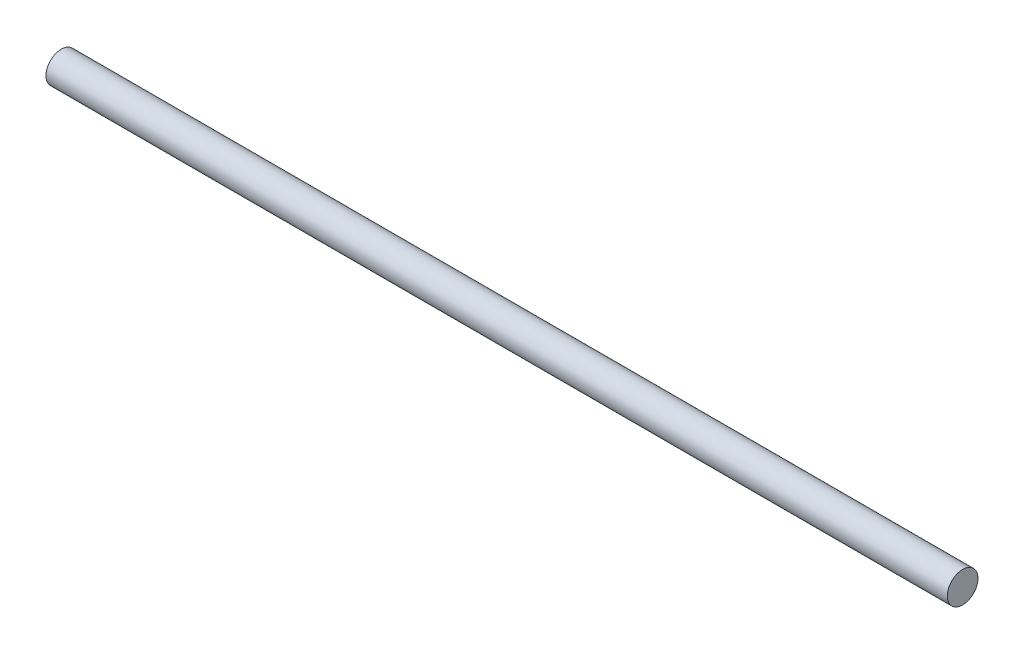
ISO-10303-21;
HEADER;
FILE_DESCRIPTION(('STEP AP214'),'2;1');
FILE_NAME('part.step','',(''),(''),'','','');
FILE_SCHEMA(('AUTOMOTIVE_DESIGN { 1 0 10303 214 1 1 1 1 }'));
ENDSEC;
DATA;
#1=APPLICATION_CONTEXT('core data for automotive mechanical design processes');
#2=APPLICATION_PROTOCOL_DEFINITION('international standard','automotive_design',2000,#1);
#3=PRODUCT_CONTEXT('',#1,'mechanical');
#4=PRODUCT('Part','Part','',(#3));
#5=PRODUCT_RELATED_PRODUCT_CATEGORY('part','',(#4));
#6=PRODUCT_DEFINITION_FORMATION('','',#4);
#7=PRODUCT_DEFINITION_CONTEXT('part definition',#1,'design');
#8=PRODUCT_DEFINITION('design','',#6,#7);
#9=PRODUCT_DEFINITION_SHAPE('','',#8);
#10=(LENGTH_UNIT() NAMED_UNIT(*) SI_UNIT(.MILLI.,.METRE.));
#11=(NAMED_UNIT(*) PLANE_ANGLE_UNIT() SI_UNIT($,.RADIAN.));
#12=(NAMED_UNIT(*) SI_UNIT($,.STERADIAN.) SOLID_ANGLE_UNIT());
#13=UNCERTAINTY_MEASURE_WITH_UNIT(LENGTH_MEASURE(1.E-05),#10,'distance_accuracy_value','');
#14=(GEOMETRIC_REPRESENTATION_CONTEXT(3) GLOBAL_UNCERTAINTY_ASSIGNED_CONTEXT((#13)) GLOBAL_UNIT_ASSIGNED_CONTEXT((#10,
#11,#12)) REPRESENTATION_CONTEXT('',''));
#15=CARTESIAN_POINT('',(0.,0.,0.));
#16=DIRECTION('',(0.,0.,1.));
#17=DIRECTION('',(1.,0.,0.));
#18=AXIS2_PLACEMENT_3D('',#15,#16,#17);
#19=CARTESIAN_POINT('',(175.825,0.,0.));
#20=DIRECTION('',(-1.,0.,0.));
#21=DIRECTION('',(0.,0.,1.));
#22=AXIS2_PLACEMENT_3D('',#19,#20,#21);
#23=CYLINDRICAL_SURFACE('',#22,6.00000000000001);
#24=CARTESIAN_POINT('',(175.825,0.,0.));
#25=DIRECTION('',(1.,0.,0.));
#26=DIRECTION('',(0.,0.,-1.));
#27=AXIS2_PLACEMENT_3D('',#24,#25,#26);
#28=CIRCLE('',#27,6.00000000000001);
#29=CARTESIAN_POINT('',(175.825,0.,-6.00000000000001));
#30=VERTEX_POINT('',#29);
#31=EDGE_CURVE('E10',#30,#30,#28,.T.);
#32=ORIENTED_EDGE('',*,*,#31,.F.);
#33=EDGE_LOOP('',(#32));
#34=FACE_BOUND('',#33,.T.);
#35=CARTESIAN_POINT('',(-175.825,0.,0.));
#36=DIRECTION('',(1.,0.,0.));
#37=DIRECTION('',(0.,0.,-1.));
#38=AXIS2_PLACEMENT_3D('',#35,#36,#37);
#39=CIRCLE('',#38,6.00000000000001);
#40=CARTESIAN_POINT('',(-175.825,0.,-6.00000000000001));
#41=VERTEX_POINT('',#40);
#42=EDGE_CURVE('E42',#41,#41,#39,.T.);
#43=ORIENTED_EDGE('',*,*,#42,.T.);
#44=EDGE_LOOP('',(#43));
#45=FACE_BOUND('',#44,.T.);
#46=ADVANCED_FACE('F39',(#34,#45),#23,.T.);
#47=CARTESIAN_POINT('',(175.825,0.,0.));
#48=DIRECTION('',(1.,0.,0.));
#49=DIRECTION('',(0.,0.,-1.));
#50=AXIS2_PLACEMENT_3D('',#47,#48,#49);
#51=PLANE('',#50);
#52=ORIENTED_EDGE('',*,*,#31,.T.);
#53=EDGE_LOOP('',(#52));
#54=FACE_BOUND('',#53,.T.);
#55=ADVANCED_FACE('F56',(#54),#51,.T.);
#56=CARTESIAN_POINT('',(-175.825,0.,0.));
#57=DIRECTION('',(1.,0.,0.));
#58=DIRECTION('',(0.,0.,-1.));
#59=AXIS2_PLACEMENT_3D('',#56,#57,#58);
#60=PLANE('',#59);
#61=ORIENTED_EDGE('',*,*,#42,.F.);
#62=EDGE_LOOP('',(#61));
#63=FACE_BOUND('',#62,.T.);
#64=ADVANCED_FACE('F54',(#63),#60,.F.);
#65=CLOSED_SHELL('',(#46,#55,#64));
#66=MANIFOLD_SOLID_BREP('B2',#65);
#67=ADVANCED_BREP_SHAPE_REPRESENTATION('',(#18,#66),#14);
#68=SHAPE_DEFINITION_REPRESENTATION(#9,#67);
ENDSEC;
END-ISO-10303-21;
